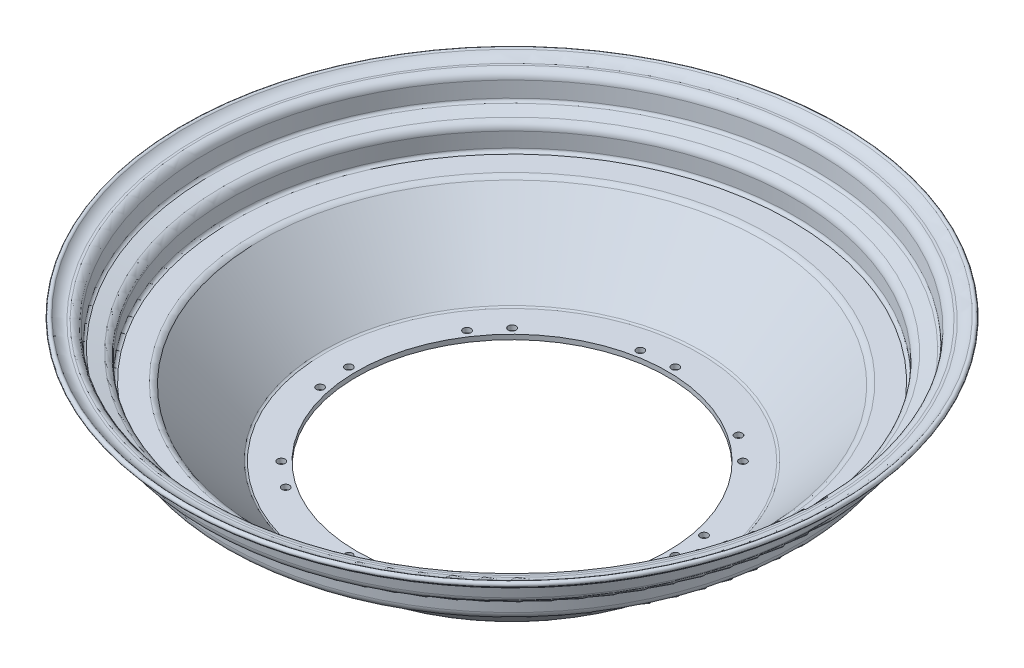
ISO-10303-21;
HEADER;
FILE_DESCRIPTION(('STEP AP214'),'2;1');
FILE_NAME('part.step','',(''),(''),'','','');
FILE_SCHEMA(('AUTOMOTIVE_DESIGN { 1 0 10303 214 1 1 1 1 }'));
ENDSEC;
DATA;
#1=APPLICATION_CONTEXT('core data for automotive mechanical design processes');
#2=APPLICATION_PROTOCOL_DEFINITION('international standard','automotive_design',2000,#1);
#3=PRODUCT_CONTEXT('',#1,'mechanical');
#4=PRODUCT('Part','Part','',(#3));
#5=PRODUCT_RELATED_PRODUCT_CATEGORY('part','',(#4));
#6=PRODUCT_DEFINITION_FORMATION('','',#4);
#7=PRODUCT_DEFINITION_CONTEXT('part definition',#1,'design');
#8=PRODUCT_DEFINITION('design','',#6,#7);
#9=PRODUCT_DEFINITION_SHAPE('','',#8);
#10=(LENGTH_UNIT() NAMED_UNIT(*) SI_UNIT(.MILLI.,.METRE.));
#11=(NAMED_UNIT(*) PLANE_ANGLE_UNIT() SI_UNIT($,.RADIAN.));
#12=(NAMED_UNIT(*) SI_UNIT($,.STERADIAN.) SOLID_ANGLE_UNIT());
#13=UNCERTAINTY_MEASURE_WITH_UNIT(LENGTH_MEASURE(1.E-05),#10,'distance_accuracy_value','');
#14=(GEOMETRIC_REPRESENTATION_CONTEXT(3) GLOBAL_UNCERTAINTY_ASSIGNED_CONTEXT((#13)) GLOBAL_UNIT_ASSIGNED_CONTEXT((#10,
#11,#12)) REPRESENTATION_CONTEXT('',''));
#15=CARTESIAN_POINT('',(0.,0.,0.));
#16=DIRECTION('',(0.,0.,1.));
#17=DIRECTION('',(1.,0.,0.));
#18=AXIS2_PLACEMENT_3D('',#15,#16,#17);
#19=CARTESIAN_POINT('',(0.,5.18,0.));
#20=DIRECTION('',(0.,1.,0.));
#21=DIRECTION('',(0.,0.,1.));
#22=AXIS2_PLACEMENT_3D('',#19,#20,#21);
#23=TOROIDAL_SURFACE('',#22,182.87389946701,5.17999999999999);
#24=CARTESIAN_POINT('',(0.,0.,0.));
#25=DIRECTION('',(0.,1.,0.));
#26=DIRECTION('',(0.,0.,1.));
#27=AXIS2_PLACEMENT_3D('',#24,#25,#26);
#28=CIRCLE('',#27,182.87389946701);
#29=CARTESIAN_POINT('',(0.,0.,182.87389946701));
#30=VERTEX_POINT('',#29);
#31=EDGE_CURVE('E10',#30,#30,#28,.T.);
#32=ORIENTED_EDGE('',*,*,#31,.T.);
#33=EDGE_LOOP('',(#32));
#34=FACE_BOUND('',#33,.T.);
#35=CARTESIAN_POINT('',(0.,5.18000000000005,0.));
#36=DIRECTION('',(0.,1.,0.));
#37=DIRECTION('',(0.,0.,1.));
#38=AXIS2_PLACEMENT_3D('',#35,#36,#37);
#39=CIRCLE('',#38,188.05389946701);
#40=CARTESIAN_POINT('',(0.,5.18000000000005,188.05389946701));
#41=VERTEX_POINT('',#40);
#42=EDGE_CURVE('E120',#41,#41,#39,.T.);
#43=ORIENTED_EDGE('',*,*,#42,.F.);
#44=EDGE_LOOP('',(#43));
#45=FACE_BOUND('',#44,.T.);
#46=ADVANCED_FACE('F39',(#34,#45),#23,.T.);
#47=CARTESIAN_POINT('',(-182.87389946701,0.,0.));
#48=DIRECTION('',(0.,-1.,0.));
#49=DIRECTION('',(0.,0.,-1.));
#50=AXIS2_PLACEMENT_3D('',#47,#48,#49);
#51=PLANE('',#50);
#52=CARTESIAN_POINT('',(0.,0.,0.));
#53=DIRECTION('',(0.,1.,0.));
#54=DIRECTION('',(0.,0.,1.));
#55=AXIS2_PLACEMENT_3D('',#52,#53,#54);
#56=CIRCLE('',#55,167.290305146331);
#57=CARTESIAN_POINT('',(0.,0.,167.290305146331));
#58=VERTEX_POINT('',#57);
#59=EDGE_CURVE('E47',#58,#58,#56,.T.);
#60=ORIENTED_EDGE('',*,*,#59,.T.);
#61=EDGE_LOOP('',(#60));
#62=FACE_BOUND('',#61,.T.);
#63=ORIENTED_EDGE('',*,*,#31,.F.);
#64=EDGE_LOOP('',(#63));
#65=FACE_BOUND('',#64,.T.);
#66=ADVANCED_FACE('F249',(#62,#65),#51,.T.);
#67=CARTESIAN_POINT('',(0.,0.,0.));
#68=DIRECTION('',(0.,1.,0.));
#69=DIRECTION('',(0.,0.,1.));
#70=AXIS2_PLACEMENT_3D('',#67,#68,#69);
#71=CONICAL_SURFACE('',#70,167.290305146331,0.754293493918973);
#72=CARTESIAN_POINT('',(0.,-43.3736492391518,0.));
#73=DIRECTION('',(0.,1.,0.));
#74=DIRECTION('',(0.,0.,1.));
#75=AXIS2_PLACEMENT_3D('',#72,#73,#74);
#76=CIRCLE('',#75,126.534324491361);
#77=CARTESIAN_POINT('',(0.,-43.3736492391518,126.534324491361));
#78=VERTEX_POINT('',#77);
#79=EDGE_CURVE('E53',#78,#78,#76,.T.);
#80=ORIENTED_EDGE('',*,*,#79,.T.);
#81=EDGE_LOOP('',(#80));
#82=FACE_BOUND('',#81,.T.);
#83=ORIENTED_EDGE('',*,*,#59,.F.);
#84=EDGE_LOOP('',(#83));
#85=FACE_BOUND('',#84,.T.);
#86=ADVANCED_FACE('F234',(#82,#85),#71,.T.);
#87=CARTESIAN_POINT('',(0.,-39.8265200776849,0.));
#88=DIRECTION('',(0.,1.,0.));
#89=DIRECTION('',(0.,0.,1.));
#90=AXIS2_PLACEMENT_3D('',#87,#88,#89);
#91=TOROIDAL_SURFACE('',#90,122.759370887424,5.18);
#92=CARTESIAN_POINT('',(0.,-45.0065200776849,0.));
#93=DIRECTION('',(0.,1.,0.));
#94=DIRECTION('',(0.,0.,1.));
#95=AXIS2_PLACEMENT_3D('',#92,#93,#94);
#96=CIRCLE('',#95,122.759370887424);
#97=CARTESIAN_POINT('',(0.,-45.0065200776849,122.759370887424));
#98=VERTEX_POINT('',#97);
#99=EDGE_CURVE('E227',#98,#98,#96,.T.);
#100=ORIENTED_EDGE('',*,*,#99,.T.);
#101=EDGE_LOOP('',(#100));
#102=FACE_BOUND('',#101,.T.);
#103=ORIENTED_EDGE('',*,*,#79,.F.);
#104=EDGE_LOOP('',(#103));
#105=FACE_BOUND('',#104,.T.);
#106=ADVANCED_FACE('F237',(#102,#105),#91,.T.);
#107=CARTESIAN_POINT('',(-102.,-45.0065200776849,0.));
#108=DIRECTION('',(0.,-1.,0.));
#109=DIRECTION('',(0.,0.,-1.));
#110=AXIS2_PLACEMENT_3D('',#107,#108,#109);
#111=PLANE('',#110);
#112=CARTESIAN_POINT('',(75.6604255869607,-45.0065200776849,-75.6604255869605));
#113=DIRECTION('',(0.,1.,0.));
#114=DIRECTION('',(0.,0.,1.));
#115=AXIS2_PLACEMENT_3D('',#112,#113,#114);
#116=CIRCLE('',#115,2.50000000000008);
#117=CARTESIAN_POINT('',(75.6604255869607,-45.0065200776849,-73.1604255869604));
#118=VERTEX_POINT('',#117);
#119=EDGE_CURVE('E678',#118,#118,#116,.T.);
#120=ORIENTED_EDGE('',*,*,#119,.T.);
#121=EDGE_LOOP('',(#120));
#122=FACE_BOUND('',#121,.T.);
#123=CARTESIAN_POINT('',(-20.8746644557252,-45.0065200776849,-104.944025003146));
#124=DIRECTION('',(0.,1.,0.));
#125=DIRECTION('',(0.,0.,1.));
#126=AXIS2_PLACEMENT_3D('',#123,#124,#125);
#127=CIRCLE('',#126,2.50000000000009);
#128=CARTESIAN_POINT('',(-20.8746644557252,-45.0065200776849,-102.444025003146));
#129=VERTEX_POINT('',#128);
#130=EDGE_CURVE('E680',#129,#129,#127,.T.);
#131=ORIENTED_EDGE('',*,*,#130,.T.);
#132=EDGE_LOOP('',(#131));
#133=FACE_BOUND('',#132,.T.);
#134=CARTESIAN_POINT('',(-75.6604255869597,-45.0065200776849,-75.6604255869615));
#135=DIRECTION('',(0.,1.,0.));
#136=DIRECTION('',(0.,0.,1.));
#137=AXIS2_PLACEMENT_3D('',#134,#135,#136);
#138=CIRCLE('',#137,2.5000000000001);
#139=CARTESIAN_POINT('',(-75.6604255869597,-45.0065200776849,-73.1604255869614));
#140=VERTEX_POINT('',#139);
#141=EDGE_CURVE('E726',#140,#140,#138,.T.);
#142=ORIENTED_EDGE('',*,*,#141,.T.);
#143=EDGE_LOOP('',(#142));
#144=FACE_BOUND('',#143,.T.);
#145=CARTESIAN_POINT('',(-104.944025003146,-45.0065200776849,20.8746644557241));
#146=DIRECTION('',(0.,1.,0.));
#147=DIRECTION('',(0.,0.,1.));
#148=AXIS2_PLACEMENT_3D('',#145,#146,#147);
#149=CIRCLE('',#148,2.50000000000009);
#150=CARTESIAN_POINT('',(-104.944025003146,-45.0065200776849,23.3746644557242));
#151=VERTEX_POINT('',#150);
#152=EDGE_CURVE('E722',#151,#151,#149,.T.);
#153=ORIENTED_EDGE('',*,*,#152,.T.);
#154=EDGE_LOOP('',(#153));
#155=FACE_BOUND('',#154,.T.);
#156=CARTESIAN_POINT('',(-107.,-45.0065200776849,-1.12076550976865E-12));
#157=DIRECTION('',(0.,1.,0.));
#158=DIRECTION('',(0.,0.,1.));
#159=AXIS2_PLACEMENT_3D('',#156,#157,#158);
#160=CIRCLE('',#159,2.50000000000008);
#161=CARTESIAN_POINT('',(-107.,-45.0065200776849,2.49999999999896));
#162=VERTEX_POINT('',#161);
#163=EDGE_CURVE('E718',#162,#162,#160,.T.);
#164=ORIENTED_EDGE('',*,*,#163,.T.);
#165=EDGE_LOOP('',(#164));
#166=FACE_BOUND('',#165,.T.);
#167=CARTESIAN_POINT('',(-59.4460149330986,-45.0065200776849,88.9672485163714));
#168=DIRECTION('',(0.,1.,0.));
#169=DIRECTION('',(0.,0.,1.));
#170=AXIS2_PLACEMENT_3D('',#167,#168,#169);
#171=CIRCLE('',#170,2.5000000000001);
#172=CARTESIAN_POINT('',(-59.4460149330986,-45.0065200776849,91.4672485163715));
#173=VERTEX_POINT('',#172);
#174=EDGE_CURVE('E714',#173,#173,#171,.T.);
#175=ORIENTED_EDGE('',*,*,#174,.T.);
#176=EDGE_LOOP('',(#175));
#177=FACE_BOUND('',#176,.T.);
#178=CARTESIAN_POINT('',(-88.9672485163712,-45.0065200776849,-59.4460149330989));
#179=DIRECTION('',(0.,1.,0.));
#180=DIRECTION('',(0.,0.,1.));
#181=AXIS2_PLACEMENT_3D('',#178,#179,#180);
#182=CIRCLE('',#181,2.50000000000008);
#183=CARTESIAN_POINT('',(-88.9672485163712,-45.0065200776849,-56.9460149330988));
#184=VERTEX_POINT('',#183);
#185=EDGE_CURVE('E730',#184,#184,#182,.T.);
#186=ORIENTED_EDGE('',*,*,#185,.T.);
#187=EDGE_LOOP('',(#186));
#188=FACE_BOUND('',#187,.T.);
#189=CARTESIAN_POINT('',(75.6604255869601,-45.0065200776849,75.660425586961));
#190=DIRECTION('',(0.,1.,0.));
#191=DIRECTION('',(0.,0.,1.));
#192=AXIS2_PLACEMENT_3D('',#189,#190,#191);
#193=CIRCLE('',#192,2.50000000000008);
#194=CARTESIAN_POINT('',(75.6604255869601,-45.0065200776849,78.1604255869611));
#195=VERTEX_POINT('',#194);
#196=EDGE_CURVE('E694',#195,#195,#193,.T.);
#197=ORIENTED_EDGE('',*,*,#196,.T.);
#198=EDGE_LOOP('',(#197));
#199=FACE_BOUND('',#198,.T.);
#200=CARTESIAN_POINT('',(104.944025003146,-45.0065200776849,-20.8746644557248));
#201=DIRECTION('',(0.,1.,0.));
#202=DIRECTION('',(0.,0.,1.));
#203=AXIS2_PLACEMENT_3D('',#200,#201,#202);
#204=CIRCLE('',#203,2.50000000000009);
#205=CARTESIAN_POINT('',(104.944025003146,-45.0065200776849,-18.3746644557247));
#206=VERTEX_POINT('',#205);
#207=EDGE_CURVE('E692',#206,#206,#204,.T.);
#208=ORIENTED_EDGE('',*,*,#207,.T.);
#209=EDGE_LOOP('',(#208));
#210=FACE_BOUND('',#209,.T.);
#211=CARTESIAN_POINT('',(107.,-45.0065200776849,3.73588503256215E-13));
#212=DIRECTION('',(0.,1.,0.));
#213=DIRECTION('',(0.,0.,1.));
#214=AXIS2_PLACEMENT_3D('',#211,#212,#213);
#215=CIRCLE('',#214,2.50000000000008);
#216=CARTESIAN_POINT('',(107.,-45.0065200776849,2.50000000000046));
#217=VERTEX_POINT('',#216);
#218=EDGE_CURVE('E687',#217,#217,#215,.T.);
#219=ORIENTED_EDGE('',*,*,#218,.T.);
#220=EDGE_LOOP('',(#219));
#221=FACE_BOUND('',#220,.T.);
#222=CARTESIAN_POINT('',(59.446014933098,-45.0065200776849,-88.9672485163719));
#223=DIRECTION('',(0.,1.,0.));
#224=DIRECTION('',(0.,0.,1.));
#225=AXIS2_PLACEMENT_3D('',#222,#223,#224);
#226=CIRCLE('',#225,2.50000000000007);
#227=CARTESIAN_POINT('',(59.446014933098,-45.0065200776849,-86.4672485163718));
#228=VERTEX_POINT('',#227);
#229=EDGE_CURVE('E681',#228,#228,#226,.T.);
#230=ORIENTED_EDGE('',*,*,#229,.T.);
#231=EDGE_LOOP('',(#230));
#232=FACE_BOUND('',#231,.T.);
#233=CARTESIAN_POINT('',(-75.6604255869613,-45.0065200776849,75.6604255869599));
#234=DIRECTION('',(0.,1.,0.));
#235=DIRECTION('',(0.,0.,1.));
#236=AXIS2_PLACEMENT_3D('',#233,#234,#235);
#237=CIRCLE('',#236,2.50000000000008);
#238=CARTESIAN_POINT('',(-75.6604255869613,-45.0065200776849,78.16042558696));
#239=VERTEX_POINT('',#238);
#240=EDGE_CURVE('E710',#239,#239,#237,.T.);
#241=ORIENTED_EDGE('',*,*,#240,.T.);
#242=EDGE_LOOP('',(#241));
#243=FACE_BOUND('',#242,.T.);
#244=CARTESIAN_POINT('',(20.8746644557244,-45.0065200776849,104.944025003146));
#245=DIRECTION('',(0.,1.,0.));
#246=DIRECTION('',(0.,0.,1.));
#247=AXIS2_PLACEMENT_3D('',#244,#245,#246);
#248=CIRCLE('',#247,2.50000000000009);
#249=CARTESIAN_POINT('',(20.8746644557244,-45.0065200776849,107.444025003146));
#250=VERTEX_POINT('',#249);
#251=EDGE_CURVE('E706',#250,#250,#248,.T.);
#252=ORIENTED_EDGE('',*,*,#251,.T.);
#253=EDGE_LOOP('',(#252));
#254=FACE_BOUND('',#253,.T.);
#255=CARTESIAN_POINT('',(-7.47177006512431E-13,-45.0065200776849,107.));
#256=DIRECTION('',(0.,1.,0.));
#257=DIRECTION('',(0.,0.,1.));
#258=AXIS2_PLACEMENT_3D('',#255,#256,#257);
#259=CIRCLE('',#258,2.50000000000009);
#260=CARTESIAN_POINT('',(-7.47177006512431E-13,-45.0065200776849,109.5));
#261=VERTEX_POINT('',#260);
#262=EDGE_CURVE('E702',#261,#261,#259,.T.);
#263=ORIENTED_EDGE('',*,*,#262,.T.);
#264=EDGE_LOOP('',(#263));
#265=FACE_BOUND('',#264,.T.);
#266=CARTESIAN_POINT('',(88.9672485163716,-45.0065200776849,59.4460149330983));
#267=DIRECTION('',(0.,1.,0.));
#268=DIRECTION('',(0.,0.,1.));
#269=AXIS2_PLACEMENT_3D('',#266,#267,#268);
#270=CIRCLE('',#269,2.50000000000009);
#271=CARTESIAN_POINT('',(88.9672485163716,-45.0065200776849,61.9460149330984));
#272=VERTEX_POINT('',#271);
#273=EDGE_CURVE('E698',#272,#272,#270,.T.);
#274=ORIENTED_EDGE('',*,*,#273,.T.);
#275=EDGE_LOOP('',(#274));
#276=FACE_BOUND('',#275,.T.);
#277=CARTESIAN_POINT('',(0.,-45.0065200776849,-107.));
#278=DIRECTION('',(0.,1.,0.));
#279=DIRECTION('',(0.,0.,1.));
#280=AXIS2_PLACEMENT_3D('',#277,#278,#279);
#281=CIRCLE('',#280,2.50000000000009);
#282=CARTESIAN_POINT('',(0.,-45.0065200776849,-104.5));
#283=VERTEX_POINT('',#282);
#284=EDGE_CURVE('E62',#283,#283,#281,.T.);
#285=ORIENTED_EDGE('',*,*,#284,.T.);
#286=EDGE_LOOP('',(#285));
#287=FACE_BOUND('',#286,.T.);
#288=CARTESIAN_POINT('',(0.,-45.0065200776849,0.));
#289=DIRECTION('',(0.,1.,0.));
#290=DIRECTION('',(0.,0.,1.));
#291=AXIS2_PLACEMENT_3D('',#288,#289,#290);
#292=CIRCLE('',#291,102.);
#293=CARTESIAN_POINT('',(0.,-45.0065200776849,102.));
#294=VERTEX_POINT('',#293);
#295=EDGE_CURVE('E223',#294,#294,#292,.T.);
#296=ORIENTED_EDGE('',*,*,#295,.T.);
#297=EDGE_LOOP('',(#296));
#298=FACE_BOUND('',#297,.T.);
#299=ORIENTED_EDGE('',*,*,#99,.F.);
#300=EDGE_LOOP('',(#299));
#301=FACE_BOUND('',#300,.T.);
#302=ADVANCED_FACE('F239',(#122,#133,#144,#155,#166,#177,#188,#199,#210,#221,#232,#243,#254,
#265,#276,#287,#298,#301),#111,.T.);
#303=CARTESIAN_POINT('',(0.,240.88895216458,0.));
#304=DIRECTION('',(0.,1.,0.));
#305=DIRECTION('',(0.,0.,1.));
#306=AXIS2_PLACEMENT_3D('',#303,#304,#305);
#307=CYLINDRICAL_SURFACE('',#306,102.);
#308=CARTESIAN_POINT('',(0.,-41.8885200775344,0.));
#309=DIRECTION('',(0.,1.,0.));
#310=DIRECTION('',(0.,0.,1.));
#311=AXIS2_PLACEMENT_3D('',#308,#309,#310);
#312=CIRCLE('',#311,102.);
#313=CARTESIAN_POINT('',(0.,-41.8885200775344,102.));
#314=VERTEX_POINT('',#313);
#315=EDGE_CURVE('E219',#314,#314,#312,.T.);
#316=ORIENTED_EDGE('',*,*,#315,.T.);
#317=EDGE_LOOP('',(#316));
#318=FACE_BOUND('',#317,.T.);
#319=ORIENTED_EDGE('',*,*,#295,.F.);
#320=EDGE_LOOP('',(#319));
#321=FACE_BOUND('',#320,.T.);
#322=ADVANCED_FACE('F246',(#318,#321),#307,.F.);
#323=CARTESIAN_POINT('',(-122.707973697463,-41.8885200775344,0.));
#324=DIRECTION('',(0.,1.,0.));
#325=DIRECTION('',(0.,0.,1.));
#326=AXIS2_PLACEMENT_3D('',#323,#324,#325);
#327=PLANE('',#326);
#328=CARTESIAN_POINT('',(75.6604255869607,-41.8885200775344,-75.6604255869605));
#329=DIRECTION('',(0.,1.,0.));
#330=DIRECTION('',(0.,0.,1.));
#331=AXIS2_PLACEMENT_3D('',#328,#329,#330);
#332=CIRCLE('',#331,2.50000000000008);
#333=CARTESIAN_POINT('',(75.6604255869607,-41.8885200775344,-73.1604255869604));
#334=VERTEX_POINT('',#333);
#335=EDGE_CURVE('E42',#334,#334,#332,.T.);
#336=ORIENTED_EDGE('',*,*,#335,.F.);
#337=EDGE_LOOP('',(#336));
#338=FACE_BOUND('',#337,.T.);
#339=CARTESIAN_POINT('',(-20.8746644557252,-41.8885200775344,-104.944025003146));
#340=DIRECTION('',(0.,1.,0.));
#341=DIRECTION('',(0.,0.,1.));
#342=AXIS2_PLACEMENT_3D('',#339,#340,#341);
#343=CIRCLE('',#342,2.50000000000009);
#344=CARTESIAN_POINT('',(-20.8746644557252,-41.8885200775344,-102.444025003146));
#345=VERTEX_POINT('',#344);
#346=EDGE_CURVE('E113',#345,#345,#343,.T.);
#347=ORIENTED_EDGE('',*,*,#346,.F.);
#348=EDGE_LOOP('',(#347));
#349=FACE_BOUND('',#348,.T.);
#350=CARTESIAN_POINT('',(-75.6604255869597,-41.8885200775344,-75.6604255869615));
#351=DIRECTION('',(0.,1.,0.));
#352=DIRECTION('',(0.,0.,1.));
#353=AXIS2_PLACEMENT_3D('',#350,#351,#352);
#354=CIRCLE('',#353,2.5000000000001);
#355=CARTESIAN_POINT('',(-75.6604255869597,-41.8885200775344,-73.1604255869614));
#356=VERTEX_POINT('',#355);
#357=EDGE_CURVE('E110',#356,#356,#354,.T.);
#358=ORIENTED_EDGE('',*,*,#357,.F.);
#359=EDGE_LOOP('',(#358));
#360=FACE_BOUND('',#359,.T.);
#361=CARTESIAN_POINT('',(-104.944025003146,-41.8885200775344,20.8746644557241));
#362=DIRECTION('',(0.,1.,0.));
#363=DIRECTION('',(0.,0.,1.));
#364=AXIS2_PLACEMENT_3D('',#361,#362,#363);
#365=CIRCLE('',#364,2.50000000000009);
#366=CARTESIAN_POINT('',(-104.944025003146,-41.8885200775344,23.3746644557242));
#367=VERTEX_POINT('',#366);
#368=EDGE_CURVE('E106',#367,#367,#365,.T.);
#369=ORIENTED_EDGE('',*,*,#368,.F.);
#370=EDGE_LOOP('',(#369));
#371=FACE_BOUND('',#370,.T.);
#372=CARTESIAN_POINT('',(-107.,-41.8885200775344,-1.12076550976865E-12));
#373=DIRECTION('',(0.,1.,0.));
#374=DIRECTION('',(0.,0.,1.));
#375=AXIS2_PLACEMENT_3D('',#372,#373,#374);
#376=CIRCLE('',#375,2.50000000000008);
#377=CARTESIAN_POINT('',(-107.,-41.8885200775344,2.49999999999896));
#378=VERTEX_POINT('',#377);
#379=EDGE_CURVE('E102',#378,#378,#376,.T.);
#380=ORIENTED_EDGE('',*,*,#379,.F.);
#381=EDGE_LOOP('',(#380));
#382=FACE_BOUND('',#381,.T.);
#383=CARTESIAN_POINT('',(-59.4460149330986,-41.8885200775344,88.9672485163714));
#384=DIRECTION('',(0.,1.,0.));
#385=DIRECTION('',(0.,0.,1.));
#386=AXIS2_PLACEMENT_3D('',#383,#384,#385);
#387=CIRCLE('',#386,2.5000000000001);
#388=CARTESIAN_POINT('',(-59.4460149330986,-41.8885200775344,91.4672485163715));
#389=VERTEX_POINT('',#388);
#390=EDGE_CURVE('E98',#389,#389,#387,.T.);
#391=ORIENTED_EDGE('',*,*,#390,.F.);
#392=EDGE_LOOP('',(#391));
#393=FACE_BOUND('',#392,.T.);
#394=CARTESIAN_POINT('',(-88.9672485163712,-41.8885200775344,-59.4460149330989));
#395=DIRECTION('',(0.,1.,0.));
#396=DIRECTION('',(0.,0.,1.));
#397=AXIS2_PLACEMENT_3D('',#394,#395,#396);
#398=CIRCLE('',#397,2.50000000000008);
#399=CARTESIAN_POINT('',(-88.9672485163712,-41.8885200775344,-56.9460149330988));
#400=VERTEX_POINT('',#399);
#401=EDGE_CURVE('E94',#400,#400,#398,.T.);
#402=ORIENTED_EDGE('',*,*,#401,.F.);
#403=EDGE_LOOP('',(#402));
#404=FACE_BOUND('',#403,.T.);
#405=CARTESIAN_POINT('',(75.6604255869601,-41.8885200775344,75.660425586961));
#406=DIRECTION('',(0.,1.,0.));
#407=DIRECTION('',(0.,0.,1.));
#408=AXIS2_PLACEMENT_3D('',#405,#406,#407);
#409=CIRCLE('',#408,2.50000000000008);
#410=CARTESIAN_POINT('',(75.6604255869601,-41.8885200775344,78.1604255869611));
#411=VERTEX_POINT('',#410);
#412=EDGE_CURVE('E90',#411,#411,#409,.T.);
#413=ORIENTED_EDGE('',*,*,#412,.F.);
#414=EDGE_LOOP('',(#413));
#415=FACE_BOUND('',#414,.T.);
#416=CARTESIAN_POINT('',(104.944025003146,-41.8885200775344,-20.8746644557248));
#417=DIRECTION('',(0.,1.,0.));
#418=DIRECTION('',(0.,0.,1.));
#419=AXIS2_PLACEMENT_3D('',#416,#417,#418);
#420=CIRCLE('',#419,2.50000000000009);
#421=CARTESIAN_POINT('',(104.944025003146,-41.8885200775344,-18.3746644557247));
#422=VERTEX_POINT('',#421);
#423=EDGE_CURVE('E86',#422,#422,#420,.T.);
#424=ORIENTED_EDGE('',*,*,#423,.F.);
#425=EDGE_LOOP('',(#424));
#426=FACE_BOUND('',#425,.T.);
#427=CARTESIAN_POINT('',(107.,-41.8885200775344,3.73588503256215E-13));
#428=DIRECTION('',(0.,1.,0.));
#429=DIRECTION('',(0.,0.,1.));
#430=AXIS2_PLACEMENT_3D('',#427,#428,#429);
#431=CIRCLE('',#430,2.50000000000008);
#432=CARTESIAN_POINT('',(107.,-41.8885200775344,2.50000000000046));
#433=VERTEX_POINT('',#432);
#434=EDGE_CURVE('E82',#433,#433,#431,.T.);
#435=ORIENTED_EDGE('',*,*,#434,.F.);
#436=EDGE_LOOP('',(#435));
#437=FACE_BOUND('',#436,.T.);
#438=CARTESIAN_POINT('',(59.446014933098,-41.8885200775344,-88.9672485163719));
#439=DIRECTION('',(0.,1.,0.));
#440=DIRECTION('',(0.,0.,1.));
#441=AXIS2_PLACEMENT_3D('',#438,#439,#440);
#442=CIRCLE('',#441,2.50000000000007);
#443=CARTESIAN_POINT('',(59.446014933098,-41.8885200775344,-86.4672485163718));
#444=VERTEX_POINT('',#443);
#445=EDGE_CURVE('E78',#444,#444,#442,.T.);
#446=ORIENTED_EDGE('',*,*,#445,.F.);
#447=EDGE_LOOP('',(#446));
#448=FACE_BOUND('',#447,.T.);
#449=CARTESIAN_POINT('',(-75.6604255869613,-41.8885200775344,75.6604255869599));
#450=DIRECTION('',(0.,1.,0.));
#451=DIRECTION('',(0.,0.,1.));
#452=AXIS2_PLACEMENT_3D('',#449,#450,#451);
#453=CIRCLE('',#452,2.50000000000008);
#454=CARTESIAN_POINT('',(-75.6604255869613,-41.8885200775344,78.16042558696));
#455=VERTEX_POINT('',#454);
#456=EDGE_CURVE('E74',#455,#455,#453,.T.);
#457=ORIENTED_EDGE('',*,*,#456,.F.);
#458=EDGE_LOOP('',(#457));
#459=FACE_BOUND('',#458,.T.);
#460=CARTESIAN_POINT('',(20.8746644557244,-41.8885200775344,104.944025003146));
#461=DIRECTION('',(0.,1.,0.));
#462=DIRECTION('',(0.,0.,1.));
#463=AXIS2_PLACEMENT_3D('',#460,#461,#462);
#464=CIRCLE('',#463,2.50000000000009);
#465=CARTESIAN_POINT('',(20.8746644557244,-41.8885200775344,107.444025003146));
#466=VERTEX_POINT('',#465);
#467=EDGE_CURVE('E70',#466,#466,#464,.T.);
#468=ORIENTED_EDGE('',*,*,#467,.F.);
#469=EDGE_LOOP('',(#468));
#470=FACE_BOUND('',#469,.T.);
#471=CARTESIAN_POINT('',(-7.47177006512431E-13,-41.8885200775344,107.));
#472=DIRECTION('',(0.,1.,0.));
#473=DIRECTION('',(0.,0.,1.));
#474=AXIS2_PLACEMENT_3D('',#471,#472,#473);
#475=CIRCLE('',#474,2.50000000000009);
#476=CARTESIAN_POINT('',(-7.47177006512431E-13,-41.8885200775344,109.5));
#477=VERTEX_POINT('',#476);
#478=EDGE_CURVE('E66',#477,#477,#475,.T.);
#479=ORIENTED_EDGE('',*,*,#478,.F.);
#480=EDGE_LOOP('',(#479));
#481=FACE_BOUND('',#480,.T.);
#482=CARTESIAN_POINT('',(88.9672485163716,-41.8885200775344,59.4460149330983));
#483=DIRECTION('',(0.,1.,0.));
#484=DIRECTION('',(0.,0.,1.));
#485=AXIS2_PLACEMENT_3D('',#482,#483,#484);
#486=CIRCLE('',#485,2.50000000000009);
#487=CARTESIAN_POINT('',(88.9672485163716,-41.8885200775344,61.9460149330984));
#488=VERTEX_POINT('',#487);
#489=EDGE_CURVE('E61',#488,#488,#486,.T.);
#490=ORIENTED_EDGE('',*,*,#489,.F.);
#491=EDGE_LOOP('',(#490));
#492=FACE_BOUND('',#491,.T.);
#493=CARTESIAN_POINT('',(0.,-41.8885200775344,-107.));
#494=DIRECTION('',(0.,1.,0.));
#495=DIRECTION('',(0.,0.,1.));
#496=AXIS2_PLACEMENT_3D('',#493,#494,#495);
#497=CIRCLE('',#496,2.50000000000009);
#498=CARTESIAN_POINT('',(0.,-41.8885200775344,-104.5));
#499=VERTEX_POINT('',#498);
#500=EDGE_CURVE('E57',#499,#499,#497,.T.);
#501=ORIENTED_EDGE('',*,*,#500,.F.);
#502=EDGE_LOOP('',(#501));
#503=FACE_BOUND('',#502,.T.);
#504=CARTESIAN_POINT('',(0.,-41.8885200775344,0.));
#505=DIRECTION('',(0.,1.,0.));
#506=DIRECTION('',(0.,0.,1.));
#507=AXIS2_PLACEMENT_3D('',#504,#505,#506);
#508=CIRCLE('',#507,122.707973697463);
#509=CARTESIAN_POINT('',(0.,-41.8885200775344,122.707973697463));
#510=VERTEX_POINT('',#509);
#511=EDGE_CURVE('E215',#510,#510,#508,.T.);
#512=ORIENTED_EDGE('',*,*,#511,.T.);
#513=EDGE_LOOP('',(#512));
#514=FACE_BOUND('',#513,.T.);
#515=ORIENTED_EDGE('',*,*,#315,.F.);
#516=EDGE_LOOP('',(#515));
#517=FACE_BOUND('',#516,.T.);
#518=ADVANCED_FACE('F279',(#338,#349,#360,#371,#382,#393,#404,#415,#426,#437,#448,#459,#470,
#481,#492,#503,#514,#517),#327,.T.);
#519=CARTESIAN_POINT('',(0.,-39.8885200775344,0.));
#520=DIRECTION('',(0.,1.,0.));
#521=DIRECTION('',(0.,0.,1.));
#522=AXIS2_PLACEMENT_3D('',#519,#520,#521);
#523=TOROIDAL_SURFACE('',#522,122.707973697463,2.);
#524=CARTESIAN_POINT('',(0.,-41.2580680163247,0.));
#525=DIRECTION('',(0.,1.,0.));
#526=DIRECTION('',(0.,0.,1.));
#527=AXIS2_PLACEMENT_3D('',#524,#525,#526);
#528=CIRCLE('',#527,124.165484741454);
#529=CARTESIAN_POINT('',(0.,-41.2580680163247,124.165484741454));
#530=VERTEX_POINT('',#529);
#531=EDGE_CURVE('E211',#530,#530,#528,.T.);
#532=ORIENTED_EDGE('',*,*,#531,.T.);
#533=EDGE_LOOP('',(#532));
#534=FACE_BOUND('',#533,.T.);
#535=ORIENTED_EDGE('',*,*,#511,.F.);
#536=EDGE_LOOP('',(#535));
#537=FACE_BOUND('',#536,.T.);
#538=ADVANCED_FACE('F287',(#534,#537),#523,.F.);
#539=CARTESIAN_POINT('',(0.,-41.2580680163247,0.));
#540=DIRECTION('',(0.,1.,0.));
#541=DIRECTION('',(0.,0.,1.));
#542=AXIS2_PLACEMENT_3D('',#539,#540,#541);
#543=CONICAL_SURFACE('',#542,124.165484741454,0.754293493918973);
#544=CARTESIAN_POINT('',(0.,1.54212916146693,0.));
#545=DIRECTION('',(0.,1.,0.));
#546=DIRECTION('',(0.,0.,1.));
#547=AXIS2_PLACEMENT_3D('',#544,#545,#546);
#548=CIRCLE('',#547,164.382622077281);
#549=CARTESIAN_POINT('',(0.,1.54212916146693,164.382622077281));
#550=VERTEX_POINT('',#549);
#551=EDGE_CURVE('E207',#550,#550,#548,.T.);
#552=ORIENTED_EDGE('',*,*,#551,.T.);
#553=EDGE_LOOP('',(#552));
#554=FACE_BOUND('',#553,.T.);
#555=ORIENTED_EDGE('',*,*,#531,.F.);
#556=EDGE_LOOP('',(#555));
#557=FACE_BOUND('',#556,.T.);
#558=ADVANCED_FACE('F292',(#554,#557),#543,.F.);
#559=CARTESIAN_POINT('',(0.,-2.005,0.));
#560=DIRECTION('',(0.,1.,0.));
#561=DIRECTION('',(0.,0.,1.));
#562=AXIS2_PLACEMENT_3D('',#559,#560,#561);
#563=TOROIDAL_SURFACE('',#562,168.157575681218,5.18);
#564=CARTESIAN_POINT('',(0.,3.17500000000001,0.));
#565=DIRECTION('',(0.,1.,0.));
#566=DIRECTION('',(0.,0.,1.));
#567=AXIS2_PLACEMENT_3D('',#564,#565,#566);
#568=CIRCLE('',#567,168.157575681218);
#569=CARTESIAN_POINT('',(0.,3.17500000000001,168.157575681218));
#570=VERTEX_POINT('',#569);
#571=EDGE_CURVE('E203',#570,#570,#568,.T.);
#572=ORIENTED_EDGE('',*,*,#571,.T.);
#573=EDGE_LOOP('',(#572));
#574=FACE_BOUND('',#573,.T.);
#575=ORIENTED_EDGE('',*,*,#551,.F.);
#576=EDGE_LOOP('',(#575));
#577=FACE_BOUND('',#576,.T.);
#578=ADVANCED_FACE('F302',(#574,#577),#563,.T.);
#579=CARTESIAN_POINT('',(-182.87889946701,3.175,0.));
#580=DIRECTION('',(0.,1.,0.));
#581=DIRECTION('',(0.,0.,1.));
#582=AXIS2_PLACEMENT_3D('',#579,#580,#581);
#583=PLANE('',#582);
#584=CARTESIAN_POINT('',(0.,3.17500000000001,0.));
#585=DIRECTION('',(0.,1.,0.));
#586=DIRECTION('',(0.,0.,1.));
#587=AXIS2_PLACEMENT_3D('',#584,#585,#586);
#588=CIRCLE('',#587,182.87889946701);
#589=CARTESIAN_POINT('',(0.,3.17500000000001,182.87889946701));
#590=VERTEX_POINT('',#589);
#591=EDGE_CURVE('E199',#590,#590,#588,.T.);
#592=ORIENTED_EDGE('',*,*,#591,.T.);
#593=EDGE_LOOP('',(#592));
#594=FACE_BOUND('',#593,.T.);
#595=ORIENTED_EDGE('',*,*,#571,.F.);
#596=EDGE_LOOP('',(#595));
#597=FACE_BOUND('',#596,.T.);
#598=ADVANCED_FACE('F312',(#594,#597),#583,.T.);
#599=CARTESIAN_POINT('',(0.,5.175,0.));
#600=DIRECTION('',(0.,1.,0.));
#601=DIRECTION('',(0.,0.,1.));
#602=AXIS2_PLACEMENT_3D('',#599,#600,#601);
#603=TOROIDAL_SURFACE('',#602,182.87889946701,2.);
#604=CARTESIAN_POINT('',(0.,5.17500000000001,0.));
#605=DIRECTION('',(0.,1.,0.));
#606=DIRECTION('',(0.,0.,1.));
#607=AXIS2_PLACEMENT_3D('',#604,#605,#606);
#608=CIRCLE('',#607,184.87889946701);
#609=CARTESIAN_POINT('',(0.,5.17500000000001,184.87889946701));
#610=VERTEX_POINT('',#609);
#611=EDGE_CURVE('E195',#610,#610,#608,.T.);
#612=ORIENTED_EDGE('',*,*,#611,.T.);
#613=EDGE_LOOP('',(#612));
#614=FACE_BOUND('',#613,.T.);
#615=ORIENTED_EDGE('',*,*,#591,.F.);
#616=EDGE_LOOP('',(#615));
#617=FACE_BOUND('',#616,.T.);
#618=ADVANCED_FACE('F322',(#614,#617),#603,.F.);
#619=CARTESIAN_POINT('',(0.,240.88895216458,0.));
#620=DIRECTION('',(0.,1.,0.));
#621=DIRECTION('',(0.,0.,1.));
#622=AXIS2_PLACEMENT_3D('',#619,#620,#621);
#623=CYLINDRICAL_SURFACE('',#622,184.87889946701);
#624=CARTESIAN_POINT('',(0.,14.867499271066,0.));
#625=DIRECTION('',(0.,1.,0.));
#626=DIRECTION('',(0.,0.,1.));
#627=AXIS2_PLACEMENT_3D('',#624,#625,#626);
#628=CIRCLE('',#627,184.87889946701);
#629=CARTESIAN_POINT('',(0.,14.867499271066,184.87889946701));
#630=VERTEX_POINT('',#629);
#631=EDGE_CURVE('E191',#630,#630,#628,.T.);
#632=ORIENTED_EDGE('',*,*,#631,.T.);
#633=EDGE_LOOP('',(#632));
#634=FACE_BOUND('',#633,.T.);
#635=ORIENTED_EDGE('',*,*,#611,.F.);
#636=EDGE_LOOP('',(#635));
#637=FACE_BOUND('',#636,.T.);
#638=ADVANCED_FACE('F332',(#634,#637),#623,.F.);
#639=CARTESIAN_POINT('',(0.,14.867499271066,0.));
#640=DIRECTION('',(0.,1.,0.));
#641=DIRECTION('',(0.,0.,1.));
#642=AXIS2_PLACEMENT_3D('',#639,#640,#641);
#643=TOROIDAL_SURFACE('',#642,190.05889946701,5.17999999999999);
#644=CARTESIAN_POINT('',(0.,19.9153914307043,0.));
#645=DIRECTION('',(0.,1.,0.));
#646=DIRECTION('',(0.,0.,1.));
#647=AXIS2_PLACEMENT_3D('',#644,#645,#646);
#648=CIRCLE('',#647,188.896494742027);
#649=CARTESIAN_POINT('',(0.,19.9153914307043,188.896494742027));
#650=VERTEX_POINT('',#649);
#651=EDGE_CURVE('E187',#650,#650,#648,.T.);
#652=ORIENTED_EDGE('',*,*,#651,.T.);
#653=EDGE_LOOP('',(#652));
#654=FACE_BOUND('',#653,.T.);
#655=ORIENTED_EDGE('',*,*,#631,.F.);
#656=EDGE_LOOP('',(#655));
#657=FACE_BOUND('',#656,.T.);
#658=ADVANCED_FACE('F342',(#654,#657),#643,.T.);
#659=CARTESIAN_POINT('',(0.,19.9153914307043,0.));
#660=DIRECTION('',(0.,1.,0.));
#661=DIRECTION('',(0.,0.,1.));
#662=AXIS2_PLACEMENT_3D('',#659,#660,#661);
#663=CONICAL_SURFACE('',#662,188.896494742027,1.3444665156361);
#664=CARTESIAN_POINT('',(0.,21.8526178798795,0.));
#665=DIRECTION('',(0.,1.,0.));
#666=DIRECTION('',(0.,0.,1.));
#667=AXIS2_PLACEMENT_3D('',#664,#665,#666);
#668=CIRCLE('',#667,197.309149985129);
#669=CARTESIAN_POINT('',(0.,21.8526178798795,197.309149985129));
#670=VERTEX_POINT('',#669);
#671=EDGE_CURVE('E183',#670,#670,#668,.T.);
#672=ORIENTED_EDGE('',*,*,#671,.T.);
#673=EDGE_LOOP('',(#672));
#674=FACE_BOUND('',#673,.T.);
#675=ORIENTED_EDGE('',*,*,#651,.F.);
#676=EDGE_LOOP('',(#675));
#677=FACE_BOUND('',#676,.T.);
#678=ADVANCED_FACE('F352',(#674,#677),#663,.F.);
#679=CARTESIAN_POINT('',(0.,23.801610991709,0.));
#680=DIRECTION('',(0.,1.,0.));
#681=DIRECTION('',(0.,0.,1.));
#682=AXIS2_PLACEMENT_3D('',#679,#680,#681);
#683=TOROIDAL_SURFACE('',#682,196.860345072008,2.);
#684=CARTESIAN_POINT('',(0.,23.6272995062136,0.));
#685=DIRECTION('',(0.,1.,0.));
#686=DIRECTION('',(0.,0.,1.));
#687=AXIS2_PLACEMENT_3D('',#684,#685,#686);
#688=CIRCLE('',#687,198.852734468192);
#689=CARTESIAN_POINT('',(0.,23.6272995062136,198.852734468192));
#690=VERTEX_POINT('',#689);
#691=EDGE_CURVE('E179',#690,#690,#688,.T.);
#692=ORIENTED_EDGE('',*,*,#691,.T.);
#693=EDGE_LOOP('',(#692));
#694=FACE_BOUND('',#693,.T.);
#695=ORIENTED_EDGE('',*,*,#671,.F.);
#696=EDGE_LOOP('',(#695));
#697=FACE_BOUND('',#696,.T.);
#698=ADVANCED_FACE('F362',(#694,#697),#683,.F.);
#699=CARTESIAN_POINT('',(0.,23.6272995062136,0.));
#700=DIRECTION('',(0.,1.,0.));
#701=DIRECTION('',(0.,0.,1.));
#702=AXIS2_PLACEMENT_3D('',#699,#700,#701);
#703=CONICAL_SURFACE('',#702,198.852734468192,0.0872664625997168);
#704=CARTESIAN_POINT('',(0.,33.3330306370932,0.));
#705=DIRECTION('',(0.,1.,0.));
#706=DIRECTION('',(0.,0.,1.));
#707=AXIS2_PLACEMENT_3D('',#704,#705,#706);
#708=CIRCLE('',#707,199.701875913375);
#709=CARTESIAN_POINT('',(0.,33.3330306370932,199.701875913375));
#710=VERTEX_POINT('',#709);
#711=EDGE_CURVE('E175',#710,#710,#708,.T.);
#712=ORIENTED_EDGE('',*,*,#711,.T.);
#713=EDGE_LOOP('',(#712));
#714=FACE_BOUND('',#713,.T.);
#715=ORIENTED_EDGE('',*,*,#691,.F.);
#716=EDGE_LOOP('',(#715));
#717=FACE_BOUND('',#716,.T.);
#718=ADVANCED_FACE('F372',(#714,#717),#703,.F.);
#719=CARTESIAN_POINT('',(0.,32.881999668374,0.));
#720=DIRECTION('',(0.,1.,0.));
#721=DIRECTION('',(0.,0.,1.));
#722=AXIS2_PLACEMENT_3D('',#719,#720,#721);
#723=TOROIDAL_SURFACE('',#722,204.857183476,5.17500000000078);
#724=CARTESIAN_POINT('',(0.,38.0569996683748,0.));
#725=DIRECTION('',(0.,1.,0.));
#726=DIRECTION('',(0.,0.,1.));
#727=AXIS2_PLACEMENT_3D('',#724,#725,#726);
#728=CIRCLE('',#727,204.857183476);
#729=CARTESIAN_POINT('',(0.,38.0569996683748,204.857183476));
#730=VERTEX_POINT('',#729);
#731=EDGE_CURVE('E171',#730,#730,#728,.T.);
#732=ORIENTED_EDGE('',*,*,#731,.T.);
#733=EDGE_LOOP('',(#732));
#734=FACE_BOUND('',#733,.T.);
#735=ORIENTED_EDGE('',*,*,#711,.F.);
#736=EDGE_LOOP('',(#735));
#737=FACE_BOUND('',#736,.T.);
#738=ADVANCED_FACE('F382',(#734,#737),#723,.T.);
#739=CARTESIAN_POINT('',(-204.857183476,38.0569996683742,0.));
#740=DIRECTION('',(0.,1.,0.));
#741=DIRECTION('',(0.,0.,1.));
#742=AXIS2_PLACEMENT_3D('',#739,#740,#741);
#743=PLANE('',#742);
#744=CARTESIAN_POINT('',(0.,38.0569996683736,0.));
#745=DIRECTION('',(0.,1.,0.));
#746=DIRECTION('',(0.,0.,1.));
#747=AXIS2_PLACEMENT_3D('',#744,#745,#746);
#748=CIRCLE('',#747,206.357183498617);
#749=CARTESIAN_POINT('',(0.,38.0569996683736,206.357183498617));
#750=VERTEX_POINT('',#749);
#751=EDGE_CURVE('E167',#750,#750,#748,.T.);
#752=ORIENTED_EDGE('',*,*,#751,.T.);
#753=EDGE_LOOP('',(#752));
#754=FACE_BOUND('',#753,.T.);
#755=ORIENTED_EDGE('',*,*,#731,.F.);
#756=EDGE_LOOP('',(#755));
#757=FACE_BOUND('',#756,.T.);
#758=ADVANCED_FACE('F392',(#754,#757),#743,.T.);
#759=CARTESIAN_POINT('',(0.,47.4389997084663,0.));
#760=DIRECTION('',(0.,1.,0.));
#761=DIRECTION('',(0.,0.,1.));
#762=AXIS2_PLACEMENT_3D('',#759,#760,#761);
#763=TOROIDAL_SURFACE('',#762,206.357183566697,9.38200004009267);
#764=CARTESIAN_POINT('',(0.,41.1399264458523,0.));
#765=DIRECTION('',(0.,1.,0.));
#766=DIRECTION('',(0.,0.,1.));
#767=AXIS2_PLACEMENT_3D('',#764,#765,#766);
#768=CIRCLE('',#767,213.310139828929);
#769=CARTESIAN_POINT('',(0.,41.1399264458523,213.310139828929));
#770=VERTEX_POINT('',#769);
#771=EDGE_CURVE('E163',#770,#770,#768,.T.);
#772=ORIENTED_EDGE('',*,*,#771,.T.);
#773=EDGE_LOOP('',(#772));
#774=FACE_BOUND('',#773,.T.);
#775=ORIENTED_EDGE('',*,*,#751,.F.);
#776=EDGE_LOOP('',(#775));
#777=FACE_BOUND('',#776,.T.);
#778=ADVANCED_FACE('F402',(#774,#777),#763,.F.);
#779=CARTESIAN_POINT('',(0.,40.0932141057942,0.));
#780=DIRECTION('',(0.,1.,0.));
#781=DIRECTION('',(0.,0.,1.));
#782=AXIS2_PLACEMENT_3D('',#779,#780,#781);
#783=TOROIDAL_SURFACE('',#782,214.465507422888,1.55900000000074);
#784=CARTESIAN_POINT('',(0.,39.0465017657306,0.));
#785=DIRECTION('',(0.,1.,0.));
#786=DIRECTION('',(0.,0.,1.));
#787=AXIS2_PLACEMENT_3D('',#784,#785,#786);
#788=CIRCLE('',#787,215.620875016844);
#789=CARTESIAN_POINT('',(0.,39.0465017657306,215.620875016844));
#790=VERTEX_POINT('',#789);
#791=EDGE_CURVE('E159',#790,#790,#788,.T.);
#792=ORIENTED_EDGE('',*,*,#791,.T.);
#793=EDGE_LOOP('',(#792));
#794=FACE_BOUND('',#793,.T.);
#795=ORIENTED_EDGE('',*,*,#771,.F.);
#796=EDGE_LOOP('',(#795));
#797=FACE_BOUND('',#796,.T.);
#798=ADVANCED_FACE('F412',(#794,#797),#783,.T.);
#799=CARTESIAN_POINT('',(0.,47.3818939617421,0.));
#800=DIRECTION('',(0.,1.,0.));
#801=DIRECTION('',(0.,0.,1.));
#802=AXIS2_PLACEMENT_3D('',#799,#800,#801);
#803=TOROIDAL_SURFACE('',#802,206.305766969097,12.5000000401009);
#804=CARTESIAN_POINT('',(0.,34.8819996683748,0.));
#805=DIRECTION('',(0.,1.,0.));
#806=DIRECTION('',(0.,0.,1.));
#807=AXIS2_PLACEMENT_3D('',#804,#805,#806);
#808=CIRCLE('',#807,206.357183475997);
#809=CARTESIAN_POINT('',(0.,34.8819996683748,206.357183475997));
#810=VERTEX_POINT('',#809);
#811=EDGE_CURVE('E155',#810,#810,#808,.T.);
#812=ORIENTED_EDGE('',*,*,#811,.T.);
#813=EDGE_LOOP('',(#812));
#814=FACE_BOUND('',#813,.T.);
#815=ORIENTED_EDGE('',*,*,#791,.F.);
#816=EDGE_LOOP('',(#815));
#817=FACE_BOUND('',#816,.T.);
#818=ADVANCED_FACE('F422',(#814,#817),#803,.T.);
#819=CARTESIAN_POINT('',(-206.357183475997,34.8819996683748,0.));
#820=DIRECTION('',(0.,-1.,0.));
#821=DIRECTION('',(0.,0.,-1.));
#822=AXIS2_PLACEMENT_3D('',#819,#820,#821);
#823=PLANE('',#822);
#824=CARTESIAN_POINT('',(0.,34.8819996683748,0.));
#825=DIRECTION('',(0.,1.,0.));
#826=DIRECTION('',(0.,0.,1.));
#827=AXIS2_PLACEMENT_3D('',#824,#825,#826);
#828=CIRCLE('',#827,204.857183475997);
#829=CARTESIAN_POINT('',(0.,34.8819996683748,204.857183475997));
#830=VERTEX_POINT('',#829);
#831=EDGE_CURVE('E151',#830,#830,#828,.T.);
#832=ORIENTED_EDGE('',*,*,#831,.T.);
#833=EDGE_LOOP('',(#832));
#834=FACE_BOUND('',#833,.T.);
#835=ORIENTED_EDGE('',*,*,#811,.F.);
#836=EDGE_LOOP('',(#835));
#837=FACE_BOUND('',#836,.T.);
#838=ADVANCED_FACE('F432',(#834,#837),#823,.T.);
#839=CARTESIAN_POINT('',(0.,32.881999668374,0.));
#840=DIRECTION('',(0.,1.,0.));
#841=DIRECTION('',(0.,0.,1.));
#842=AXIS2_PLACEMENT_3D('',#839,#840,#841);
#843=TOROIDAL_SURFACE('',#842,204.857183476,2.00000000000078);
#844=CARTESIAN_POINT('',(0.,33.0563111538694,0.));
#845=DIRECTION('',(0.,1.,0.));
#846=DIRECTION('',(0.,0.,1.));
#847=AXIS2_PLACEMENT_3D('',#844,#845,#846);
#848=CIRCLE('',#847,202.864794079816);
#849=CARTESIAN_POINT('',(0.,33.0563111538694,202.864794079816));
#850=VERTEX_POINT('',#849);
#851=EDGE_CURVE('E147',#850,#850,#848,.T.);
#852=ORIENTED_EDGE('',*,*,#851,.T.);
#853=EDGE_LOOP('',(#852));
#854=FACE_BOUND('',#853,.T.);
#855=ORIENTED_EDGE('',*,*,#831,.F.);
#856=EDGE_LOOP('',(#855));
#857=FACE_BOUND('',#856,.T.);
#858=ADVANCED_FACE('F442',(#854,#857),#843,.F.);
#859=CARTESIAN_POINT('',(0.,33.0563111538694,0.));
#860=DIRECTION('',(0.,1.,0.));
#861=DIRECTION('',(0.,0.,1.));
#862=AXIS2_PLACEMENT_3D('',#859,#860,#861);
#863=CONICAL_SURFACE('',#862,202.864794079816,0.0872664625997167);
#864=CARTESIAN_POINT('',(0.,23.3542010547533,0.));
#865=DIRECTION('',(0.,1.,0.));
#866=DIRECTION('',(0.,0.,1.));
#867=AXIS2_PLACEMENT_3D('',#864,#865,#866);
#868=CIRCLE('',#867,202.015969433863);
#869=CARTESIAN_POINT('',(0.,23.3542010547533,202.015969433863));
#870=VERTEX_POINT('',#869);
#871=EDGE_CURVE('E143',#870,#870,#868,.T.);
#872=ORIENTED_EDGE('',*,*,#871,.T.);
#873=EDGE_LOOP('',(#872));
#874=FACE_BOUND('',#873,.T.);
#875=ORIENTED_EDGE('',*,*,#851,.F.);
#876=EDGE_LOOP('',(#875));
#877=FACE_BOUND('',#876,.T.);
#878=ADVANCED_FACE('F452',(#874,#877),#863,.T.);
#879=CARTESIAN_POINT('',(0.,23.8056678021862,0.));
#880=DIRECTION('',(0.,1.,0.));
#881=DIRECTION('',(0.,0.,1.));
#882=AXIS2_PLACEMENT_3D('',#879,#880,#881);
#883=TOROIDAL_SURFACE('',#882,196.855680897748,5.18);
#884=CARTESIAN_POINT('',(0.,18.7577756425479,0.));
#885=DIRECTION('',(0.,1.,0.));
#886=DIRECTION('',(0.,0.,1.));
#887=AXIS2_PLACEMENT_3D('',#884,#885,#886);
#888=CIRCLE('',#887,198.018085622731);
#889=CARTESIAN_POINT('',(0.,18.7577756425479,198.018085622731));
#890=VERTEX_POINT('',#889);
#891=EDGE_CURVE('E139',#890,#890,#888,.T.);
#892=ORIENTED_EDGE('',*,*,#891,.T.);
#893=EDGE_LOOP('',(#892));
#894=FACE_BOUND('',#893,.T.);
#895=ORIENTED_EDGE('',*,*,#871,.F.);
#896=EDGE_LOOP('',(#895));
#897=FACE_BOUND('',#896,.T.);
#898=ADVANCED_FACE('F462',(#894,#897),#883,.T.);
#899=CARTESIAN_POINT('',(0.,18.7577756425479,0.));
#900=DIRECTION('',(0.,1.,0.));
#901=DIRECTION('',(0.,0.,1.));
#902=AXIS2_PLACEMENT_3D('',#899,#900,#901);
#903=CONICAL_SURFACE('',#902,198.018085622731,1.3444665156361);
#904=CARTESIAN_POINT('',(0.,16.8204718610103,0.));
#905=DIRECTION('',(0.,1.,0.));
#906=DIRECTION('',(0.,0.,1.));
#907=AXIS2_PLACEMENT_3D('',#904,#905,#906);
#908=CIRCLE('',#907,189.605094553889);
#909=CARTESIAN_POINT('',(0.,16.8204718610103,189.605094553889));
#910=VERTEX_POINT('',#909);
#911=EDGE_CURVE('E131',#910,#910,#908,.T.);
#912=ORIENTED_EDGE('',*,*,#911,.T.);
#913=EDGE_LOOP('',(#912));
#914=FACE_BOUND('',#913,.T.);
#915=ORIENTED_EDGE('',*,*,#891,.F.);
#916=EDGE_LOOP('',(#915));
#917=FACE_BOUND('',#916,.T.);
#918=ADVANCED_FACE('F472',(#914,#917),#903,.T.);
#919=CARTESIAN_POINT('',(0.,14.8714787491808,0.));
#920=DIRECTION('',(0.,1.,0.));
#921=DIRECTION('',(0.,0.,1.));
#922=AXIS2_PLACEMENT_3D('',#919,#920,#921);
#923=TOROIDAL_SURFACE('',#922,190.05389946701,2.);
#924=CARTESIAN_POINT('',(0.,14.8714787491808,0.));
#925=DIRECTION('',(0.,1.,0.));
#926=DIRECTION('',(0.,0.,1.));
#927=AXIS2_PLACEMENT_3D('',#924,#925,#926);
#928=CIRCLE('',#927,188.05389946701);
#929=CARTESIAN_POINT('',(0.,14.8714787491808,188.05389946701));
#930=VERTEX_POINT('',#929);
#931=EDGE_CURVE('E125',#930,#930,#928,.T.);
#932=ORIENTED_EDGE('',*,*,#931,.T.);
#933=EDGE_LOOP('',(#932));
#934=FACE_BOUND('',#933,.T.);
#935=ORIENTED_EDGE('',*,*,#911,.F.);
#936=EDGE_LOOP('',(#935));
#937=FACE_BOUND('',#936,.T.);
#938=ADVANCED_FACE('F482',(#934,#937),#923,.F.);
#939=CARTESIAN_POINT('',(0.,240.88895216458,0.));
#940=DIRECTION('',(0.,1.,0.));
#941=DIRECTION('',(0.,0.,1.));
#942=AXIS2_PLACEMENT_3D('',#939,#940,#941);
#943=CYLINDRICAL_SURFACE('',#942,188.05389946701);
#944=ORIENTED_EDGE('',*,*,#42,.T.);
#945=EDGE_LOOP('',(#944));
#946=FACE_BOUND('',#945,.T.);
#947=ORIENTED_EDGE('',*,*,#931,.F.);
#948=EDGE_LOOP('',(#947));
#949=FACE_BOUND('',#948,.T.);
#950=ADVANCED_FACE('F492',(#946,#949),#943,.T.);
#951=CARTESIAN_POINT('',(0.,-45.0065200776849,-107.));
#952=DIRECTION('',(0.,1.,0.));
#953=DIRECTION('',(0.,0.,1.));
#954=AXIS2_PLACEMENT_3D('',#951,#952,#953);
#955=CYLINDRICAL_SURFACE('',#954,2.50000000000009);
#956=ORIENTED_EDGE('',*,*,#500,.T.);
#957=EDGE_LOOP('',(#956));
#958=FACE_BOUND('',#957,.T.);
#959=ORIENTED_EDGE('',*,*,#284,.F.);
#960=EDGE_LOOP('',(#959));
#961=FACE_BOUND('',#960,.T.);
#962=ADVANCED_FACE('F502',(#958,#961),#955,.F.);
#963=CARTESIAN_POINT('',(88.9672485163716,-45.0065200776849,59.4460149330983));
#964=DIRECTION('',(0.,1.,0.));
#965=DIRECTION('',(0.,0.,1.));
#966=AXIS2_PLACEMENT_3D('',#963,#964,#965);
#967=CYLINDRICAL_SURFACE('',#966,2.50000000000009);
#968=ORIENTED_EDGE('',*,*,#489,.T.);
#969=EDGE_LOOP('',(#968));
#970=FACE_BOUND('',#969,.T.);
#971=ORIENTED_EDGE('',*,*,#273,.F.);
#972=EDGE_LOOP('',(#971));
#973=FACE_BOUND('',#972,.T.);
#974=ADVANCED_FACE('F523',(#970,#973),#967,.F.);
#975=CARTESIAN_POINT('',(-7.47177006512431E-13,-45.0065200776849,107.));
#976=DIRECTION('',(0.,1.,0.));
#977=DIRECTION('',(0.,0.,1.));
#978=AXIS2_PLACEMENT_3D('',#975,#976,#977);
#979=CYLINDRICAL_SURFACE('',#978,2.50000000000009);
#980=ORIENTED_EDGE('',*,*,#478,.T.);
#981=EDGE_LOOP('',(#980));
#982=FACE_BOUND('',#981,.T.);
#983=ORIENTED_EDGE('',*,*,#262,.F.);
#984=EDGE_LOOP('',(#983));
#985=FACE_BOUND('',#984,.T.);
#986=ADVANCED_FACE('F533',(#982,#985),#979,.F.);
#987=CARTESIAN_POINT('',(20.8746644557244,-45.0065200776849,104.944025003146));
#988=DIRECTION('',(0.,1.,0.));
#989=DIRECTION('',(0.,0.,1.));
#990=AXIS2_PLACEMENT_3D('',#987,#988,#989);
#991=CYLINDRICAL_SURFACE('',#990,2.50000000000009);
#992=ORIENTED_EDGE('',*,*,#467,.T.);
#993=EDGE_LOOP('',(#992));
#994=FACE_BOUND('',#993,.T.);
#995=ORIENTED_EDGE('',*,*,#251,.F.);
#996=EDGE_LOOP('',(#995));
#997=FACE_BOUND('',#996,.T.);
#998=ADVANCED_FACE('F543',(#994,#997),#991,.F.);
#999=CARTESIAN_POINT('',(-75.6604255869613,-45.0065200776849,75.6604255869599));
#1000=DIRECTION('',(0.,1.,0.));
#1001=DIRECTION('',(0.,0.,1.));
#1002=AXIS2_PLACEMENT_3D('',#999,#1000,#1001);
#1003=CYLINDRICAL_SURFACE('',#1002,2.50000000000008);
#1004=ORIENTED_EDGE('',*,*,#456,.T.);
#1005=EDGE_LOOP('',(#1004));
#1006=FACE_BOUND('',#1005,.T.);
#1007=ORIENTED_EDGE('',*,*,#240,.F.);
#1008=EDGE_LOOP('',(#1007));
#1009=FACE_BOUND('',#1008,.T.);
#1010=ADVANCED_FACE('F553',(#1006,#1009),#1003,.F.);
#1011=CARTESIAN_POINT('',(59.446014933098,-45.0065200776849,-88.9672485163719));
#1012=DIRECTION('',(0.,1.,0.));
#1013=DIRECTION('',(0.,0.,1.));
#1014=AXIS2_PLACEMENT_3D('',#1011,#1012,#1013);
#1015=CYLINDRICAL_SURFACE('',#1014,2.50000000000007);
#1016=ORIENTED_EDGE('',*,*,#445,.T.);
#1017=EDGE_LOOP('',(#1016));
#1018=FACE_BOUND('',#1017,.T.);
#1019=ORIENTED_EDGE('',*,*,#229,.F.);
#1020=EDGE_LOOP('',(#1019));
#1021=FACE_BOUND('',#1020,.T.);
#1022=ADVANCED_FACE('F563',(#1018,#1021),#1015,.F.);
#1023=CARTESIAN_POINT('',(107.,-45.0065200776849,3.73588503256215E-13));
#1024=DIRECTION('',(0.,1.,0.));
#1025=DIRECTION('',(0.,0.,1.));
#1026=AXIS2_PLACEMENT_3D('',#1023,#1024,#1025);
#1027=CYLINDRICAL_SURFACE('',#1026,2.50000000000008);
#1028=ORIENTED_EDGE('',*,*,#434,.T.);
#1029=EDGE_LOOP('',(#1028));
#1030=FACE_BOUND('',#1029,.T.);
#1031=ORIENTED_EDGE('',*,*,#218,.F.);
#1032=EDGE_LOOP('',(#1031));
#1033=FACE_BOUND('',#1032,.T.);
#1034=ADVANCED_FACE('F573',(#1030,#1033),#1027,.F.);
#1035=CARTESIAN_POINT('',(104.944025003146,-45.0065200776849,-20.8746644557248));
#1036=DIRECTION('',(0.,1.,0.));
#1037=DIRECTION('',(0.,0.,1.));
#1038=AXIS2_PLACEMENT_3D('',#1035,#1036,#1037);
#1039=CYLINDRICAL_SURFACE('',#1038,2.50000000000009);
#1040=ORIENTED_EDGE('',*,*,#423,.T.);
#1041=EDGE_LOOP('',(#1040));
#1042=FACE_BOUND('',#1041,.T.);
#1043=ORIENTED_EDGE('',*,*,#207,.F.);
#1044=EDGE_LOOP('',(#1043));
#1045=FACE_BOUND('',#1044,.T.);
#1046=ADVANCED_FACE('F583',(#1042,#1045),#1039,.F.);
#1047=CARTESIAN_POINT('',(75.6604255869601,-45.0065200776849,75.660425586961));
#1048=DIRECTION('',(0.,1.,0.));
#1049=DIRECTION('',(0.,0.,1.));
#1050=AXIS2_PLACEMENT_3D('',#1047,#1048,#1049);
#1051=CYLINDRICAL_SURFACE('',#1050,2.50000000000008);
#1052=ORIENTED_EDGE('',*,*,#412,.T.);
#1053=EDGE_LOOP('',(#1052));
#1054=FACE_BOUND('',#1053,.T.);
#1055=ORIENTED_EDGE('',*,*,#196,.F.);
#1056=EDGE_LOOP('',(#1055));
#1057=FACE_BOUND('',#1056,.T.);
#1058=ADVANCED_FACE('F593',(#1054,#1057),#1051,.F.);
#1059=CARTESIAN_POINT('',(-88.9672485163712,-45.0065200776849,-59.4460149330989));
#1060=DIRECTION('',(0.,1.,0.));
#1061=DIRECTION('',(0.,0.,1.));
#1062=AXIS2_PLACEMENT_3D('',#1059,#1060,#1061);
#1063=CYLINDRICAL_SURFACE('',#1062,2.50000000000008);
#1064=ORIENTED_EDGE('',*,*,#401,.T.);
#1065=EDGE_LOOP('',(#1064));
#1066=FACE_BOUND('',#1065,.T.);
#1067=ORIENTED_EDGE('',*,*,#185,.F.);
#1068=EDGE_LOOP('',(#1067));
#1069=FACE_BOUND('',#1068,.T.);
#1070=ADVANCED_FACE('F603',(#1066,#1069),#1063,.F.);
#1071=CARTESIAN_POINT('',(-59.4460149330986,-45.0065200776849,88.9672485163714));
#1072=DIRECTION('',(0.,1.,0.));
#1073=DIRECTION('',(0.,0.,1.));
#1074=AXIS2_PLACEMENT_3D('',#1071,#1072,#1073);
#1075=CYLINDRICAL_SURFACE('',#1074,2.5000000000001);
#1076=ORIENTED_EDGE('',*,*,#390,.T.);
#1077=EDGE_LOOP('',(#1076));
#1078=FACE_BOUND('',#1077,.T.);
#1079=ORIENTED_EDGE('',*,*,#174,.F.);
#1080=EDGE_LOOP('',(#1079));
#1081=FACE_BOUND('',#1080,.T.);
#1082=ADVANCED_FACE('F613',(#1078,#1081),#1075,.F.);
#1083=CARTESIAN_POINT('',(-107.,-45.0065200776849,-1.12076550976865E-12));
#1084=DIRECTION('',(0.,1.,0.));
#1085=DIRECTION('',(0.,0.,1.));
#1086=AXIS2_PLACEMENT_3D('',#1083,#1084,#1085);
#1087=CYLINDRICAL_SURFACE('',#1086,2.50000000000008);
#1088=ORIENTED_EDGE('',*,*,#379,.T.);
#1089=EDGE_LOOP('',(#1088));
#1090=FACE_BOUND('',#1089,.T.);
#1091=ORIENTED_EDGE('',*,*,#163,.F.);
#1092=EDGE_LOOP('',(#1091));
#1093=FACE_BOUND('',#1092,.T.);
#1094=ADVANCED_FACE('F623',(#1090,#1093),#1087,.F.);
#1095=CARTESIAN_POINT('',(-104.944025003146,-45.0065200776849,20.8746644557241));
#1096=DIRECTION('',(0.,1.,0.));
#1097=DIRECTION('',(0.,0.,1.));
#1098=AXIS2_PLACEMENT_3D('',#1095,#1096,#1097);
#1099=CYLINDRICAL_SURFACE('',#1098,2.50000000000009);
#1100=ORIENTED_EDGE('',*,*,#368,.T.);
#1101=EDGE_LOOP('',(#1100));
#1102=FACE_BOUND('',#1101,.T.);
#1103=ORIENTED_EDGE('',*,*,#152,.F.);
#1104=EDGE_LOOP('',(#1103));
#1105=FACE_BOUND('',#1104,.T.);
#1106=ADVANCED_FACE('F633',(#1102,#1105),#1099,.F.);
#1107=CARTESIAN_POINT('',(-75.6604255869597,-45.0065200776849,-75.6604255869615));
#1108=DIRECTION('',(0.,1.,0.));
#1109=DIRECTION('',(0.,0.,1.));
#1110=AXIS2_PLACEMENT_3D('',#1107,#1108,#1109);
#1111=CYLINDRICAL_SURFACE('',#1110,2.5000000000001);
#1112=ORIENTED_EDGE('',*,*,#357,.T.);
#1113=EDGE_LOOP('',(#1112));
#1114=FACE_BOUND('',#1113,.T.);
#1115=ORIENTED_EDGE('',*,*,#141,.F.);
#1116=EDGE_LOOP('',(#1115));
#1117=FACE_BOUND('',#1116,.T.);
#1118=ADVANCED_FACE('F643',(#1114,#1117),#1111,.F.);
#1119=CARTESIAN_POINT('',(-20.8746644557252,-45.0065200776849,-104.944025003146));
#1120=DIRECTION('',(0.,1.,0.));
#1121=DIRECTION('',(0.,0.,1.));
#1122=AXIS2_PLACEMENT_3D('',#1119,#1120,#1121);
#1123=CYLINDRICAL_SURFACE('',#1122,2.50000000000009);
#1124=ORIENTED_EDGE('',*,*,#346,.T.);
#1125=EDGE_LOOP('',(#1124));
#1126=FACE_BOUND('',#1125,.T.);
#1127=ORIENTED_EDGE('',*,*,#130,.F.);
#1128=EDGE_LOOP('',(#1127));
#1129=FACE_BOUND('',#1128,.T.);
#1130=ADVANCED_FACE('F653',(#1126,#1129),#1123,.F.);
#1131=CARTESIAN_POINT('',(75.6604255869607,-45.0065200776849,-75.6604255869605));
#1132=DIRECTION('',(0.,1.,0.));
#1133=DIRECTION('',(0.,0.,1.));
#1134=AXIS2_PLACEMENT_3D('',#1131,#1132,#1133);
#1135=CYLINDRICAL_SURFACE('',#1134,2.50000000000008);
#1136=ORIENTED_EDGE('',*,*,#335,.T.);
#1137=EDGE_LOOP('',(#1136));
#1138=FACE_BOUND('',#1137,.T.);
#1139=ORIENTED_EDGE('',*,*,#119,.F.);
#1140=EDGE_LOOP('',(#1139));
#1141=FACE_BOUND('',#1140,.T.);
#1142=ADVANCED_FACE('F663',(#1138,#1141),#1135,.F.);
#1143=CLOSED_SHELL('',(#46,#66,#86,#106,#302,#322,#518,#538,#558,#578,#598,#618,#638,#658,#678,
#698,#718,#738,#758,#778,#798,#818,#838,#858,#878,#898,#918,#938,#950,#962,#974,#986,#998,#1010,
#1022,#1034,#1046,#1058,#1070,#1082,#1094,#1106,#1118,#1130,#1142));
#1144=MANIFOLD_SOLID_BREP('B2',#1143);
#1145=ADVANCED_BREP_SHAPE_REPRESENTATION('',(#18,#1144),#14);
#1146=SHAPE_DEFINITION_REPRESENTATION(#9,#1145);
ENDSEC;
END-ISO-10303-21;
